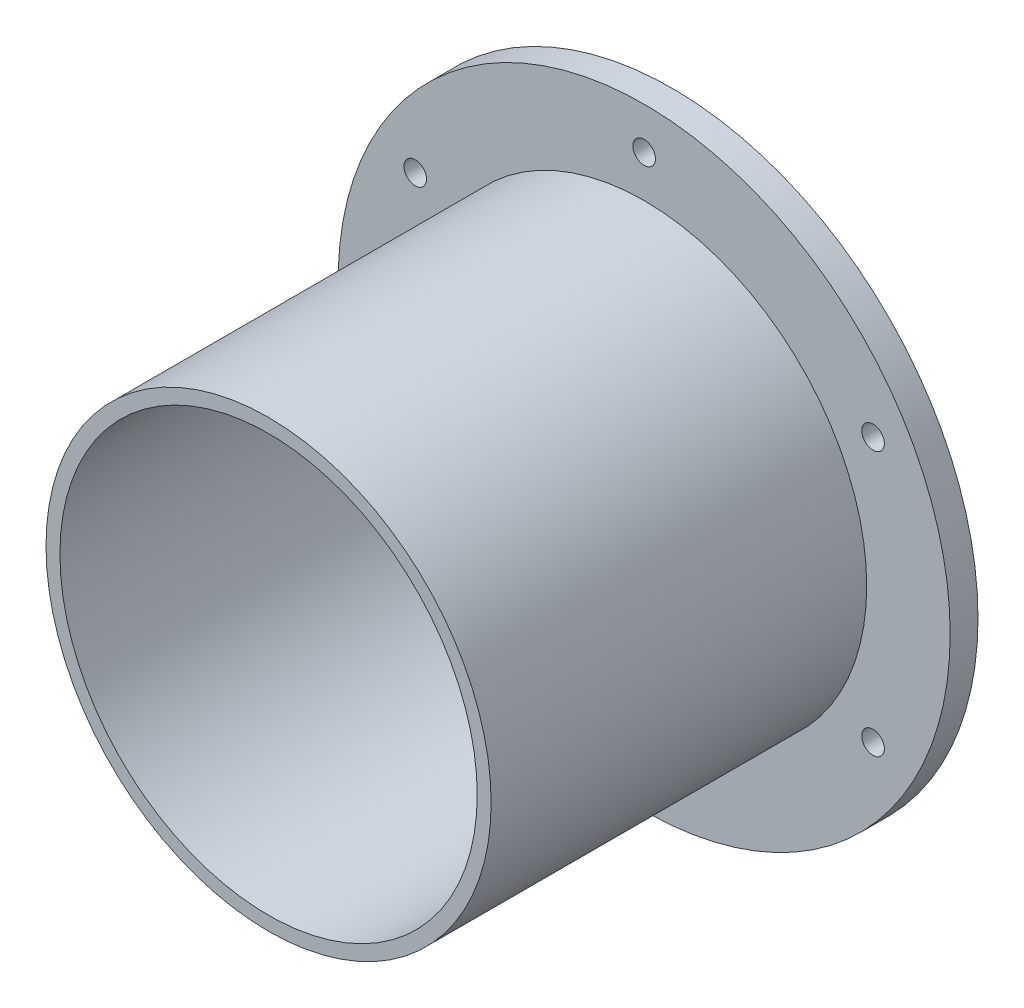
ISO-10303-21;
HEADER;
FILE_DESCRIPTION(('STEP AP214'),'2;1');
FILE_NAME('part.step','',(''),(''),'','','');
FILE_SCHEMA(('AUTOMOTIVE_DESIGN { 1 0 10303 214 1 1 1 1 }'));
ENDSEC;
DATA;
#1=APPLICATION_CONTEXT('core data for automotive mechanical design processes');
#2=APPLICATION_PROTOCOL_DEFINITION('international standard','automotive_design',2000,#1);
#3=PRODUCT_CONTEXT('',#1,'mechanical');
#4=PRODUCT('Part','Part','',(#3));
#5=PRODUCT_RELATED_PRODUCT_CATEGORY('part','',(#4));
#6=PRODUCT_DEFINITION_FORMATION('','',#4);
#7=PRODUCT_DEFINITION_CONTEXT('part definition',#1,'design');
#8=PRODUCT_DEFINITION('design','',#6,#7);
#9=PRODUCT_DEFINITION_SHAPE('','',#8);
#10=(LENGTH_UNIT() NAMED_UNIT(*) SI_UNIT(.MILLI.,.METRE.));
#11=(NAMED_UNIT(*) PLANE_ANGLE_UNIT() SI_UNIT($,.RADIAN.));
#12=(NAMED_UNIT(*) SI_UNIT($,.STERADIAN.) SOLID_ANGLE_UNIT());
#13=UNCERTAINTY_MEASURE_WITH_UNIT(LENGTH_MEASURE(1.E-05),#10,'distance_accuracy_value','');
#14=(GEOMETRIC_REPRESENTATION_CONTEXT(3) GLOBAL_UNCERTAINTY_ASSIGNED_CONTEXT((#13)) GLOBAL_UNIT_ASSIGNED_CONTEXT((#10,
#11,#12)) REPRESENTATION_CONTEXT('',''));
#15=CARTESIAN_POINT('',(0.,0.,0.));
#16=DIRECTION('',(0.,0.,1.));
#17=DIRECTION('',(1.,0.,0.));
#18=AXIS2_PLACEMENT_3D('',#15,#16,#17);
#19=CARTESIAN_POINT('',(0.,0.,6.35));
#20=DIRECTION('',(0.,0.,1.));
#21=DIRECTION('',(1.,0.,0.));
#22=AXIS2_PLACEMENT_3D('',#19,#20,#21);
#23=PLANE('',#22);
#24=CARTESIAN_POINT('',(52.2429824832962,-30.1625,6.35));
#25=DIRECTION('',(0.,0.,1.));
#26=DIRECTION('',(1.,0.,0.));
#27=AXIS2_PLACEMENT_3D('',#24,#25,#26);
#28=CIRCLE('',#27,2.57937);
#29=CARTESIAN_POINT('',(54.8223524832962,-30.1625,6.35));
#30=VERTEX_POINT('',#29);
#31=EDGE_CURVE('E392',#30,#30,#28,.T.);
#32=ORIENTED_EDGE('',*,*,#31,.F.);
#33=EDGE_LOOP('',(#32));
#34=FACE_BOUND('',#33,.T.);
#35=CARTESIAN_POINT('',(-52.2429824832963,-30.1625,6.35));
#36=DIRECTION('',(0.,0.,1.));
#37=DIRECTION('',(1.,0.,0.));
#38=AXIS2_PLACEMENT_3D('',#35,#36,#37);
#39=CIRCLE('',#38,2.57937);
#40=CARTESIAN_POINT('',(-49.6636124832963,-30.1625,6.35));
#41=VERTEX_POINT('',#40);
#42=EDGE_CURVE('E380',#41,#41,#39,.T.);
#43=ORIENTED_EDGE('',*,*,#42,.F.);
#44=EDGE_LOOP('',(#43));
#45=FACE_BOUND('',#44,.T.);
#46=CARTESIAN_POINT('',(0.,60.325,6.35));
#47=DIRECTION('',(0.,0.,1.));
#48=DIRECTION('',(1.,0.,0.));
#49=AXIS2_PLACEMENT_3D('',#46,#47,#48);
#50=CIRCLE('',#49,2.57937);
#51=CARTESIAN_POINT('',(2.57937,60.325,6.35));
#52=VERTEX_POINT('',#51);
#53=EDGE_CURVE('E366',#52,#52,#50,.T.);
#54=ORIENTED_EDGE('',*,*,#53,.F.);
#55=EDGE_LOOP('',(#54));
#56=FACE_BOUND('',#55,.T.);
#57=CARTESIAN_POINT('',(0.,0.,6.35));
#58=DIRECTION('',(0.,0.,1.));
#59=DIRECTION('',(1.,0.,0.));
#60=AXIS2_PLACEMENT_3D('',#57,#58,#59);
#61=CIRCLE('',#60,69.85);
#62=CARTESIAN_POINT('',(69.85,0.,6.35));
#63=VERTEX_POINT('',#62);
#64=EDGE_CURVE('E10',#63,#63,#61,.T.);
#65=ORIENTED_EDGE('',*,*,#64,.T.);
#66=EDGE_LOOP('',(#65));
#67=FACE_BOUND('',#66,.T.);
#68=CARTESIAN_POINT('',(0.,0.,6.35));
#69=DIRECTION('',(0.,0.,1.));
#70=DIRECTION('',(1.,0.,0.));
#71=AXIS2_PLACEMENT_3D('',#68,#69,#70);
#72=CIRCLE('',#71,50.8);
#73=CARTESIAN_POINT('',(50.8,0.,6.35));
#74=VERTEX_POINT('',#73);
#75=EDGE_CURVE('E362',#74,#74,#72,.T.);
#76=ORIENTED_EDGE('',*,*,#75,.F.);
#77=EDGE_LOOP('',(#76));
#78=FACE_BOUND('',#77,.T.);
#79=CARTESIAN_POINT('',(-52.2429824832963,30.1625,6.35));
#80=DIRECTION('',(0.,0.,1.));
#81=DIRECTION('',(1.,0.,0.));
#82=AXIS2_PLACEMENT_3D('',#79,#80,#81);
#83=CIRCLE('',#82,2.57937);
#84=CARTESIAN_POINT('',(-49.6636124832963,30.1625,6.35));
#85=VERTEX_POINT('',#84);
#86=EDGE_CURVE('E374',#85,#85,#83,.T.);
#87=ORIENTED_EDGE('',*,*,#86,.F.);
#88=EDGE_LOOP('',(#87));
#89=FACE_BOUND('',#88,.T.);
#90=CARTESIAN_POINT('',(0.,-60.325,6.35));
#91=DIRECTION('',(0.,0.,1.));
#92=DIRECTION('',(1.,0.,0.));
#93=AXIS2_PLACEMENT_3D('',#90,#91,#92);
#94=CIRCLE('',#93,2.57937);
#95=CARTESIAN_POINT('',(2.57937,-60.325,6.35));
#96=VERTEX_POINT('',#95);
#97=EDGE_CURVE('E386',#96,#96,#94,.T.);
#98=ORIENTED_EDGE('',*,*,#97,.F.);
#99=EDGE_LOOP('',(#98));
#100=FACE_BOUND('',#99,.T.);
#101=CARTESIAN_POINT('',(52.2429824832963,30.1625,6.35));
#102=DIRECTION('',(0.,0.,1.));
#103=DIRECTION('',(1.,0.,0.));
#104=AXIS2_PLACEMENT_3D('',#101,#102,#103);
#105=CIRCLE('',#104,2.57937);
#106=CARTESIAN_POINT('',(54.8223524832963,30.1625,6.35));
#107=VERTEX_POINT('',#106);
#108=EDGE_CURVE('E398',#107,#107,#105,.T.);
#109=ORIENTED_EDGE('',*,*,#108,.F.);
#110=EDGE_LOOP('',(#109));
#111=FACE_BOUND('',#110,.T.);
#112=ADVANCED_FACE('F351',(#34,#45,#56,#67,#78,#89,#100,#111),#23,.T.);
#113=CARTESIAN_POINT('',(0.,0.,0.));
#114=DIRECTION('',(0.,0.,1.));
#115=DIRECTION('',(1.,0.,0.));
#116=AXIS2_PLACEMENT_3D('',#113,#114,#115);
#117=PLANE('',#116);
#118=CARTESIAN_POINT('',(52.2429824832962,-30.1625,0.));
#119=DIRECTION('',(0.,0.,1.));
#120=DIRECTION('',(1.,0.,0.));
#121=AXIS2_PLACEMENT_3D('',#118,#119,#120);
#122=CIRCLE('',#121,2.57937);
#123=CARTESIAN_POINT('',(54.8223524832962,-30.1625,0.));
#124=VERTEX_POINT('',#123);
#125=EDGE_CURVE('E395',#124,#124,#122,.T.);
#126=ORIENTED_EDGE('',*,*,#125,.T.);
#127=EDGE_LOOP('',(#126));
#128=FACE_BOUND('',#127,.T.);
#129=CARTESIAN_POINT('',(-52.2429824832963,-30.1625,0.));
#130=DIRECTION('',(0.,0.,1.));
#131=DIRECTION('',(1.,0.,0.));
#132=AXIS2_PLACEMENT_3D('',#129,#130,#131);
#133=CIRCLE('',#132,2.57937);
#134=CARTESIAN_POINT('',(-49.6636124832963,-30.1625,0.));
#135=VERTEX_POINT('',#134);
#136=EDGE_CURVE('E383',#135,#135,#133,.T.);
#137=ORIENTED_EDGE('',*,*,#136,.T.);
#138=EDGE_LOOP('',(#137));
#139=FACE_BOUND('',#138,.T.);
#140=CARTESIAN_POINT('',(0.,60.325,0.));
#141=DIRECTION('',(0.,0.,1.));
#142=DIRECTION('',(1.,0.,0.));
#143=AXIS2_PLACEMENT_3D('',#140,#141,#142);
#144=CIRCLE('',#143,2.57937);
#145=CARTESIAN_POINT('',(2.57937,60.325,0.));
#146=VERTEX_POINT('',#145);
#147=EDGE_CURVE('E371',#146,#146,#144,.T.);
#148=ORIENTED_EDGE('',*,*,#147,.T.);
#149=EDGE_LOOP('',(#148));
#150=FACE_BOUND('',#149,.T.);
#151=CARTESIAN_POINT('',(0.,0.,0.));
#152=DIRECTION('',(0.,0.,1.));
#153=DIRECTION('',(1.,0.,0.));
#154=AXIS2_PLACEMENT_3D('',#151,#152,#153);
#155=CIRCLE('',#154,69.85);
#156=CARTESIAN_POINT('',(69.85,0.,0.));
#157=VERTEX_POINT('',#156);
#158=EDGE_CURVE('E358',#157,#157,#155,.T.);
#159=ORIENTED_EDGE('',*,*,#158,.F.);
#160=EDGE_LOOP('',(#159));
#161=FACE_BOUND('',#160,.T.);
#162=CARTESIAN_POINT('',(-52.2429824832963,30.1625,0.));
#163=DIRECTION('',(0.,0.,1.));
#164=DIRECTION('',(1.,0.,0.));
#165=AXIS2_PLACEMENT_3D('',#162,#163,#164);
#166=CIRCLE('',#165,2.57937);
#167=CARTESIAN_POINT('',(-49.6636124832963,30.1625,0.));
#168=VERTEX_POINT('',#167);
#169=EDGE_CURVE('E377',#168,#168,#166,.T.);
#170=ORIENTED_EDGE('',*,*,#169,.T.);
#171=EDGE_LOOP('',(#170));
#172=FACE_BOUND('',#171,.T.);
#173=CARTESIAN_POINT('',(0.,-60.325,0.));
#174=DIRECTION('',(0.,0.,1.));
#175=DIRECTION('',(1.,0.,0.));
#176=AXIS2_PLACEMENT_3D('',#173,#174,#175);
#177=CIRCLE('',#176,2.57937);
#178=CARTESIAN_POINT('',(2.57937,-60.325,0.));
#179=VERTEX_POINT('',#178);
#180=EDGE_CURVE('E389',#179,#179,#177,.T.);
#181=ORIENTED_EDGE('',*,*,#180,.T.);
#182=EDGE_LOOP('',(#181));
#183=FACE_BOUND('',#182,.T.);
#184=CARTESIAN_POINT('',(52.2429824832963,30.1625,0.));
#185=DIRECTION('',(0.,0.,1.));
#186=DIRECTION('',(1.,0.,0.));
#187=AXIS2_PLACEMENT_3D('',#184,#185,#186);
#188=CIRCLE('',#187,2.57937);
#189=CARTESIAN_POINT('',(54.8223524832963,30.1625,0.));
#190=VERTEX_POINT('',#189);
#191=EDGE_CURVE('E401',#190,#190,#188,.T.);
#192=ORIENTED_EDGE('',*,*,#191,.T.);
#193=EDGE_LOOP('',(#192));
#194=FACE_BOUND('',#193,.T.);
#195=CARTESIAN_POINT('',(0.,0.,0.));
#196=DIRECTION('',(0.,0.,1.));
#197=DIRECTION('',(1.,0.,0.));
#198=AXIS2_PLACEMENT_3D('',#195,#196,#197);
#199=CIRCLE('',#198,47.625);
#200=CARTESIAN_POINT('',(47.625,0.,0.));
#201=VERTEX_POINT('',#200);
#202=EDGE_CURVE('E410',#201,#201,#199,.T.);
#203=ORIENTED_EDGE('',*,*,#202,.T.);
#204=EDGE_LOOP('',(#203));
#205=FACE_BOUND('',#204,.T.);
#206=ADVANCED_FACE('F414',(#128,#139,#150,#161,#172,#183,#194,#205),#117,.F.);
#207=CARTESIAN_POINT('',(0.,0.,6.35));
#208=DIRECTION('',(0.,0.,-1.));
#209=DIRECTION('',(-1.,0.,0.));
#210=AXIS2_PLACEMENT_3D('',#207,#208,#209);
#211=CYLINDRICAL_SURFACE('',#210,69.85);
#212=ORIENTED_EDGE('',*,*,#64,.F.);
#213=EDGE_LOOP('',(#212));
#214=FACE_BOUND('',#213,.T.);
#215=ORIENTED_EDGE('',*,*,#158,.T.);
#216=EDGE_LOOP('',(#215));
#217=FACE_BOUND('',#216,.T.);
#218=ADVANCED_FACE('F353',(#214,#217),#211,.T.);
#219=CARTESIAN_POINT('',(0.,60.325,6.35));
#220=DIRECTION('',(0.,0.,-1.));
#221=DIRECTION('',(-1.,0.,0.));
#222=AXIS2_PLACEMENT_3D('',#219,#220,#221);
#223=CYLINDRICAL_SURFACE('',#222,2.57937);
#224=ORIENTED_EDGE('',*,*,#53,.T.);
#225=EDGE_LOOP('',(#224));
#226=FACE_BOUND('',#225,.T.);
#227=ORIENTED_EDGE('',*,*,#147,.F.);
#228=EDGE_LOOP('',(#227));
#229=FACE_BOUND('',#228,.T.);
#230=ADVANCED_FACE('F439',(#226,#229),#223,.F.);
#231=CARTESIAN_POINT('',(-52.2429824832963,30.1625,6.35));
#232=DIRECTION('',(0.,0.,-1.));
#233=DIRECTION('',(-1.,0.,0.));
#234=AXIS2_PLACEMENT_3D('',#231,#232,#233);
#235=CYLINDRICAL_SURFACE('',#234,2.57937);
#236=ORIENTED_EDGE('',*,*,#86,.T.);
#237=EDGE_LOOP('',(#236));
#238=FACE_BOUND('',#237,.T.);
#239=ORIENTED_EDGE('',*,*,#169,.F.);
#240=EDGE_LOOP('',(#239));
#241=FACE_BOUND('',#240,.T.);
#242=ADVANCED_FACE('F442',(#238,#241),#235,.F.);
#243=CARTESIAN_POINT('',(-52.2429824832963,-30.1625,6.35));
#244=DIRECTION('',(0.,0.,-1.));
#245=DIRECTION('',(-1.,0.,0.));
#246=AXIS2_PLACEMENT_3D('',#243,#244,#245);
#247=CYLINDRICAL_SURFACE('',#246,2.57937);
#248=ORIENTED_EDGE('',*,*,#42,.T.);
#249=EDGE_LOOP('',(#248));
#250=FACE_BOUND('',#249,.T.);
#251=ORIENTED_EDGE('',*,*,#136,.F.);
#252=EDGE_LOOP('',(#251));
#253=FACE_BOUND('',#252,.T.);
#254=ADVANCED_FACE('F446',(#250,#253),#247,.F.);
#255=CARTESIAN_POINT('',(0.,-60.325,6.35));
#256=DIRECTION('',(0.,0.,-1.));
#257=DIRECTION('',(-1.,0.,0.));
#258=AXIS2_PLACEMENT_3D('',#255,#256,#257);
#259=CYLINDRICAL_SURFACE('',#258,2.57937);
#260=ORIENTED_EDGE('',*,*,#97,.T.);
#261=EDGE_LOOP('',(#260));
#262=FACE_BOUND('',#261,.T.);
#263=ORIENTED_EDGE('',*,*,#180,.F.);
#264=EDGE_LOOP('',(#263));
#265=FACE_BOUND('',#264,.T.);
#266=ADVANCED_FACE('F450',(#262,#265),#259,.F.);
#267=CARTESIAN_POINT('',(52.2429824832962,-30.1625,6.35));
#268=DIRECTION('',(0.,0.,-1.));
#269=DIRECTION('',(-1.,0.,0.));
#270=AXIS2_PLACEMENT_3D('',#267,#268,#269);
#271=CYLINDRICAL_SURFACE('',#270,2.57937);
#272=ORIENTED_EDGE('',*,*,#31,.T.);
#273=EDGE_LOOP('',(#272));
#274=FACE_BOUND('',#273,.T.);
#275=ORIENTED_EDGE('',*,*,#125,.F.);
#276=EDGE_LOOP('',(#275));
#277=FACE_BOUND('',#276,.T.);
#278=ADVANCED_FACE('F454',(#274,#277),#271,.F.);
#279=CARTESIAN_POINT('',(52.2429824832963,30.1625,6.35));
#280=DIRECTION('',(0.,0.,-1.));
#281=DIRECTION('',(-1.,0.,0.));
#282=AXIS2_PLACEMENT_3D('',#279,#280,#281);
#283=CYLINDRICAL_SURFACE('',#282,2.57937);
#284=ORIENTED_EDGE('',*,*,#108,.T.);
#285=EDGE_LOOP('',(#284));
#286=FACE_BOUND('',#285,.T.);
#287=ORIENTED_EDGE('',*,*,#191,.F.);
#288=EDGE_LOOP('',(#287));
#289=FACE_BOUND('',#288,.T.);
#290=ADVANCED_FACE('F458',(#286,#289),#283,.F.);
#291=CARTESIAN_POINT('',(0.,0.,92.075));
#292=DIRECTION('',(0.,0.,1.));
#293=DIRECTION('',(1.,0.,0.));
#294=AXIS2_PLACEMENT_3D('',#291,#292,#293);
#295=PLANE('',#294);
#296=CARTESIAN_POINT('',(0.,0.,92.075));
#297=DIRECTION('',(0.,0.,1.));
#298=DIRECTION('',(1.,0.,0.));
#299=AXIS2_PLACEMENT_3D('',#296,#297,#298);
#300=CIRCLE('',#299,50.8);
#301=CARTESIAN_POINT('',(50.8,0.,92.075));
#302=VERTEX_POINT('',#301);
#303=EDGE_CURVE('E404',#302,#302,#300,.T.);
#304=ORIENTED_EDGE('',*,*,#303,.T.);
#305=EDGE_LOOP('',(#304));
#306=FACE_BOUND('',#305,.T.);
#307=CARTESIAN_POINT('',(0.,0.,92.075));
#308=DIRECTION('',(0.,0.,1.));
#309=DIRECTION('',(1.,0.,0.));
#310=AXIS2_PLACEMENT_3D('',#307,#308,#309);
#311=CIRCLE('',#310,47.625);
#312=CARTESIAN_POINT('',(47.625,0.,92.075));
#313=VERTEX_POINT('',#312);
#314=EDGE_CURVE('E407',#313,#313,#311,.T.);
#315=ORIENTED_EDGE('',*,*,#314,.F.);
#316=EDGE_LOOP('',(#315));
#317=FACE_BOUND('',#316,.T.);
#318=ADVANCED_FACE('F424',(#306,#317),#295,.T.);
#319=CARTESIAN_POINT('',(0.,0.,92.075));
#320=DIRECTION('',(0.,0.,-1.));
#321=DIRECTION('',(-1.,0.,0.));
#322=AXIS2_PLACEMENT_3D('',#319,#320,#321);
#323=CYLINDRICAL_SURFACE('',#322,50.8);
#324=ORIENTED_EDGE('',*,*,#75,.T.);
#325=EDGE_LOOP('',(#324));
#326=FACE_BOUND('',#325,.T.);
#327=ORIENTED_EDGE('',*,*,#303,.F.);
#328=EDGE_LOOP('',(#327));
#329=FACE_BOUND('',#328,.T.);
#330=ADVANCED_FACE('F418',(#326,#329),#323,.T.);
#331=CARTESIAN_POINT('',(0.,0.,92.075));
#332=DIRECTION('',(0.,0.,-1.));
#333=DIRECTION('',(-1.,0.,0.));
#334=AXIS2_PLACEMENT_3D('',#331,#332,#333);
#335=CYLINDRICAL_SURFACE('',#334,47.625);
#336=ORIENTED_EDGE('',*,*,#314,.T.);
#337=EDGE_LOOP('',(#336));
#338=FACE_BOUND('',#337,.T.);
#339=ORIENTED_EDGE('',*,*,#202,.F.);
#340=EDGE_LOOP('',(#339));
#341=FACE_BOUND('',#340,.T.);
#342=ADVANCED_FACE('F416',(#338,#341),#335,.F.);
#343=CLOSED_SHELL('',(#112,#206,#218,#230,#242,#254,#266,#278,#290,#318,#330,#342));
#344=MANIFOLD_SOLID_BREP('B2',#343);
#345=ADVANCED_BREP_SHAPE_REPRESENTATION('',(#18,#344),#14);
#346=SHAPE_DEFINITION_REPRESENTATION(#9,#345);
ENDSEC;
END-ISO-10303-21;
